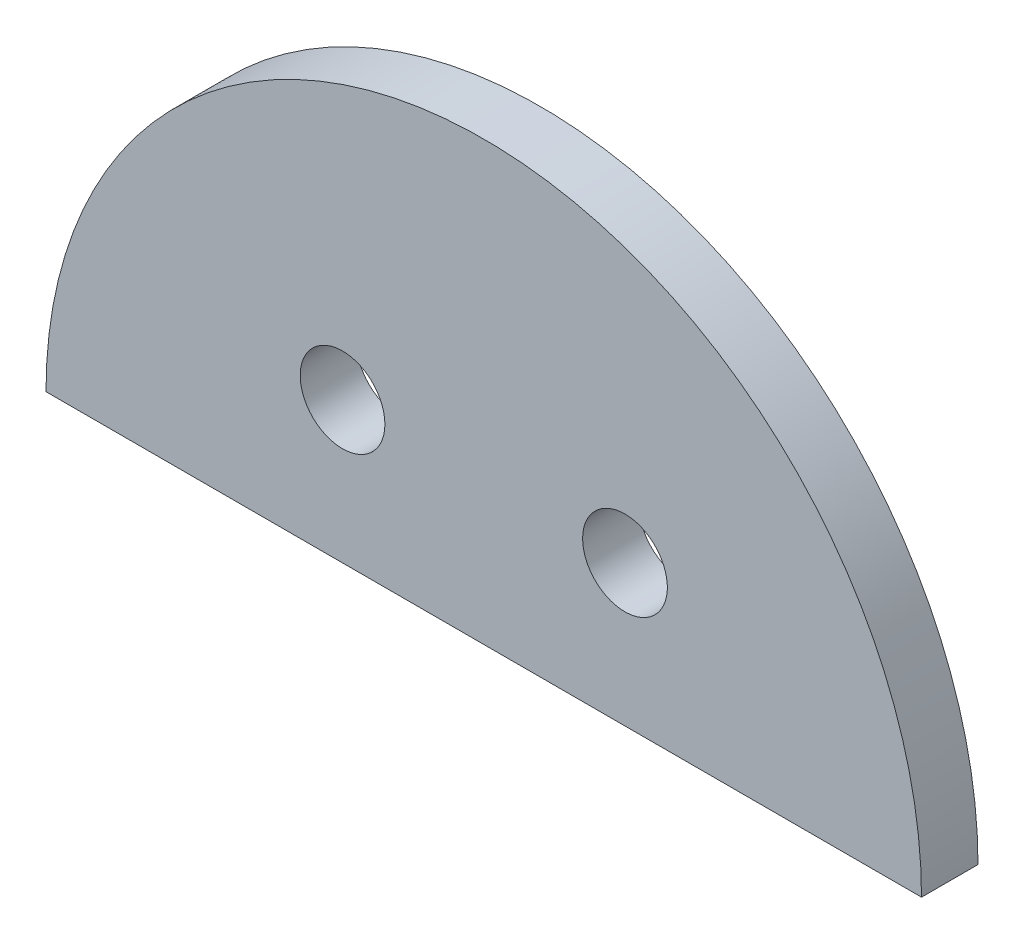
ISO-10303-21;
HEADER;
FILE_DESCRIPTION(('STEP AP214'),'2;1');
FILE_NAME('part.step','',(''),(''),'','','');
FILE_SCHEMA(('AUTOMOTIVE_DESIGN { 1 0 10303 214 1 1 1 1 }'));
ENDSEC;
DATA;
#1=APPLICATION_CONTEXT('core data for automotive mechanical design processes');
#2=APPLICATION_PROTOCOL_DEFINITION('international standard','automotive_design',2000,#1);
#3=PRODUCT_CONTEXT('',#1,'mechanical');
#4=PRODUCT('Part','Part','',(#3));
#5=PRODUCT_RELATED_PRODUCT_CATEGORY('part','',(#4));
#6=PRODUCT_DEFINITION_FORMATION('','',#4);
#7=PRODUCT_DEFINITION_CONTEXT('part definition',#1,'design');
#8=PRODUCT_DEFINITION('design','',#6,#7);
#9=PRODUCT_DEFINITION_SHAPE('','',#8);
#10=(LENGTH_UNIT() NAMED_UNIT(*) SI_UNIT(.MILLI.,.METRE.));
#11=(NAMED_UNIT(*) PLANE_ANGLE_UNIT() SI_UNIT($,.RADIAN.));
#12=(NAMED_UNIT(*) SI_UNIT($,.STERADIAN.) SOLID_ANGLE_UNIT());
#13=UNCERTAINTY_MEASURE_WITH_UNIT(LENGTH_MEASURE(1.E-05),#10,'distance_accuracy_value','');
#14=(GEOMETRIC_REPRESENTATION_CONTEXT(3) GLOBAL_UNCERTAINTY_ASSIGNED_CONTEXT((#13)) GLOBAL_UNIT_ASSIGNED_CONTEXT((#10,
#11,#12)) REPRESENTATION_CONTEXT('',''));
#15=CARTESIAN_POINT('',(0.,0.,0.));
#16=DIRECTION('',(0.,0.,1.));
#17=DIRECTION('',(1.,0.,0.));
#18=AXIS2_PLACEMENT_3D('',#15,#16,#17);
#19=CARTESIAN_POINT('',(0.,0.,2.));
#20=DIRECTION('',(0.,0.,1.));
#21=DIRECTION('',(1.,0.,0.));
#22=AXIS2_PLACEMENT_3D('',#19,#20,#21);
#23=PLANE('',#22);
#24=CARTESIAN_POINT('',(-5.,5.,2.));
#25=DIRECTION('',(0.,0.,1.));
#26=DIRECTION('',(1.,0.,0.));
#27=AXIS2_PLACEMENT_3D('',#24,#25,#26);
#28=CIRCLE('',#27,1.5);
#29=CARTESIAN_POINT('',(-3.5,5.,2.));
#30=VERTEX_POINT('',#29);
#31=EDGE_CURVE('E72',#30,#30,#28,.T.);
#32=ORIENTED_EDGE('',*,*,#31,.F.);
#33=EDGE_LOOP('',(#32));
#34=FACE_BOUND('',#33,.T.);
#35=CARTESIAN_POINT('',(0.,0.,2.));
#36=DIRECTION('',(0.,0.,1.));
#37=DIRECTION('',(1.,0.,0.));
#38=AXIS2_PLACEMENT_3D('',#35,#36,#37);
#39=CIRCLE('',#38,15.5);
#40=CARTESIAN_POINT('',(15.5,0.,2.));
#41=VERTEX_POINT('',#40);
#42=CARTESIAN_POINT('',(-15.5,0.,2.));
#43=VERTEX_POINT('',#42);
#44=EDGE_CURVE('E66',#41,#43,#39,.T.);
#45=ORIENTED_EDGE('',*,*,#44,.T.);
#46=DIRECTION('',(1.,0.,0.));
#47=VECTOR('',#46,1.);
#48=CARTESIAN_POINT('',(-15.5,0.,2.));
#49=LINE('',#48,#47);
#50=EDGE_CURVE('E51',#43,#41,#49,.T.);
#51=ORIENTED_EDGE('',*,*,#50,.T.);
#52=EDGE_LOOP('',(#45,#51));
#53=FACE_BOUND('',#52,.T.);
#54=CARTESIAN_POINT('',(5.,5.,2.));
#55=DIRECTION('',(0.,0.,1.));
#56=DIRECTION('',(-1.,0.,0.));
#57=AXIS2_PLACEMENT_3D('',#54,#55,#56);
#58=CIRCLE('',#57,1.5);
#59=CARTESIAN_POINT('',(3.5,5.,2.));
#60=VERTEX_POINT('',#59);
#61=EDGE_CURVE('E81',#60,#60,#58,.T.);
#62=ORIENTED_EDGE('',*,*,#61,.F.);
#63=EDGE_LOOP('',(#62));
#64=FACE_BOUND('',#63,.T.);
#65=ADVANCED_FACE('F35',(#34,#53,#64),#23,.T.);
#66=CARTESIAN_POINT('',(0.,0.,0.));
#67=DIRECTION('',(0.,0.,1.));
#68=DIRECTION('',(1.,0.,0.));
#69=AXIS2_PLACEMENT_3D('',#66,#67,#68);
#70=PLANE('',#69);
#71=CARTESIAN_POINT('',(-5.,5.,0.));
#72=DIRECTION('',(0.,0.,1.));
#73=DIRECTION('',(1.,0.,0.));
#74=AXIS2_PLACEMENT_3D('',#71,#72,#73);
#75=CIRCLE('',#74,1.5);
#76=CARTESIAN_POINT('',(-3.5,5.,0.));
#77=VERTEX_POINT('',#76);
#78=EDGE_CURVE('E75',#77,#77,#75,.T.);
#79=ORIENTED_EDGE('',*,*,#78,.T.);
#80=EDGE_LOOP('',(#79));
#81=FACE_BOUND('',#80,.T.);
#82=CARTESIAN_POINT('',(0.,0.,0.));
#83=DIRECTION('',(0.,0.,1.));
#84=DIRECTION('',(1.,0.,0.));
#85=AXIS2_PLACEMENT_3D('',#82,#83,#84);
#86=CIRCLE('',#85,15.5);
#87=CARTESIAN_POINT('',(15.5,0.,0.));
#88=VERTEX_POINT('',#87);
#89=CARTESIAN_POINT('',(-15.5,0.,0.));
#90=VERTEX_POINT('',#89);
#91=EDGE_CURVE('E67',#88,#90,#86,.T.);
#92=ORIENTED_EDGE('',*,*,#91,.F.);
#93=DIRECTION('',(1.,0.,0.));
#94=VECTOR('',#93,1.);
#95=CARTESIAN_POINT('',(-15.5,0.,0.));
#96=LINE('',#95,#94);
#97=EDGE_CURVE('E59',#90,#88,#96,.T.);
#98=ORIENTED_EDGE('',*,*,#97,.F.);
#99=EDGE_LOOP('',(#92,#98));
#100=FACE_BOUND('',#99,.T.);
#101=CARTESIAN_POINT('',(5.,5.,0.));
#102=DIRECTION('',(0.,0.,1.));
#103=DIRECTION('',(-1.,0.,0.));
#104=AXIS2_PLACEMENT_3D('',#101,#102,#103);
#105=CIRCLE('',#104,1.5);
#106=CARTESIAN_POINT('',(3.5,5.,0.));
#107=VERTEX_POINT('',#106);
#108=EDGE_CURVE('E83',#107,#107,#105,.T.);
#109=ORIENTED_EDGE('',*,*,#108,.T.);
#110=EDGE_LOOP('',(#109));
#111=FACE_BOUND('',#110,.T.);
#112=ADVANCED_FACE('F70',(#81,#100,#111),#70,.F.);
#113=CARTESIAN_POINT('',(0.,0.,2.));
#114=DIRECTION('',(0.,0.,-1.));
#115=DIRECTION('',(-1.,0.,0.));
#116=AXIS2_PLACEMENT_3D('',#113,#114,#115);
#117=CYLINDRICAL_SURFACE('',#116,15.5);
#118=ORIENTED_EDGE('',*,*,#91,.T.);
#119=DIRECTION('',(0.,0.,-1.));
#120=VECTOR('',#119,1.);
#121=CARTESIAN_POINT('',(-15.5,0.,2.));
#122=LINE('',#121,#120);
#123=EDGE_CURVE('E11',#43,#90,#122,.T.);
#124=ORIENTED_EDGE('',*,*,#123,.F.);
#125=ORIENTED_EDGE('',*,*,#44,.F.);
#126=DIRECTION('',(0.,0.,-1.));
#127=VECTOR('',#126,1.);
#128=CARTESIAN_POINT('',(15.5,0.,2.));
#129=LINE('',#128,#127);
#130=EDGE_CURVE('E44',#41,#88,#129,.T.);
#131=ORIENTED_EDGE('',*,*,#130,.T.);
#132=EDGE_LOOP('',(#118,#124,#125,#131));
#133=FACE_BOUND('',#132,.T.);
#134=ADVANCED_FACE('F37',(#133),#117,.T.);
#135=CARTESIAN_POINT('',(-15.5,0.,2.));
#136=DIRECTION('',(0.,1.,0.));
#137=DIRECTION('',(0.,0.,1.));
#138=AXIS2_PLACEMENT_3D('',#135,#136,#137);
#139=PLANE('',#138);
#140=ORIENTED_EDGE('',*,*,#97,.T.);
#141=ORIENTED_EDGE('',*,*,#130,.F.);
#142=ORIENTED_EDGE('',*,*,#50,.F.);
#143=ORIENTED_EDGE('',*,*,#123,.T.);
#144=EDGE_LOOP('',(#140,#141,#142,#143));
#145=FACE_BOUND('',#144,.T.);
#146=ADVANCED_FACE('F62',(#145),#139,.F.);
#147=CARTESIAN_POINT('',(-5.,5.,2.));
#148=DIRECTION('',(0.,0.,-1.));
#149=DIRECTION('',(-1.,0.,0.));
#150=AXIS2_PLACEMENT_3D('',#147,#148,#149);
#151=CYLINDRICAL_SURFACE('',#150,1.5);
#152=ORIENTED_EDGE('',*,*,#31,.T.);
#153=EDGE_LOOP('',(#152));
#154=FACE_BOUND('',#153,.T.);
#155=ORIENTED_EDGE('',*,*,#78,.F.);
#156=EDGE_LOOP('',(#155));
#157=FACE_BOUND('',#156,.T.);
#158=ADVANCED_FACE('F102',(#154,#157),#151,.F.);
#159=CARTESIAN_POINT('',(5.,5.,2.));
#160=DIRECTION('',(0.,0.,-1.));
#161=DIRECTION('',(-1.,0.,0.));
#162=AXIS2_PLACEMENT_3D('',#159,#160,#161);
#163=CYLINDRICAL_SURFACE('',#162,1.5);
#164=ORIENTED_EDGE('',*,*,#61,.T.);
#165=EDGE_LOOP('',(#164));
#166=FACE_BOUND('',#165,.T.);
#167=ORIENTED_EDGE('',*,*,#108,.F.);
#168=EDGE_LOOP('',(#167));
#169=FACE_BOUND('',#168,.T.);
#170=ADVANCED_FACE('F89',(#166,#169),#163,.F.);
#171=CLOSED_SHELL('',(#65,#112,#134,#146,#158,#170));
#172=MANIFOLD_SOLID_BREP('B2',#171);
#173=ADVANCED_BREP_SHAPE_REPRESENTATION('',(#18,#172),#14);
#174=SHAPE_DEFINITION_REPRESENTATION(#9,#173);
ENDSEC;
END-ISO-10303-21;
